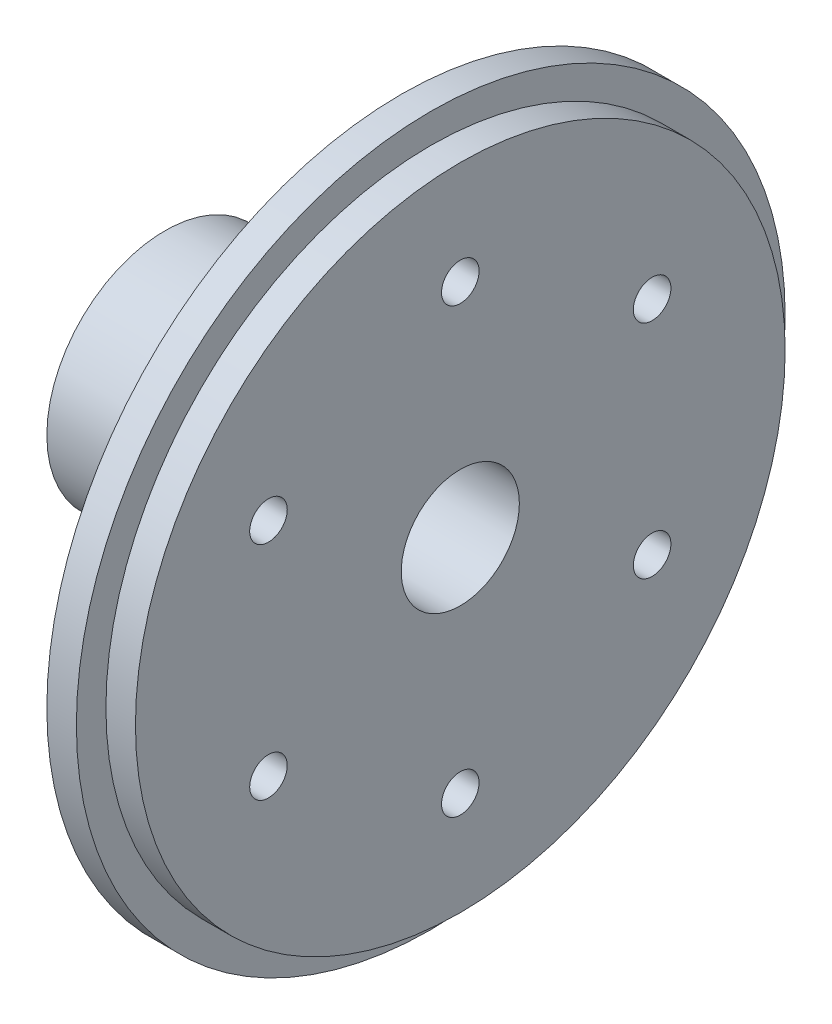
ISO-10303-21;
HEADER;
FILE_DESCRIPTION(('STEP AP214'),'2;1');
FILE_NAME('part.step','',(''),(''),'','','');
FILE_SCHEMA(('AUTOMOTIVE_DESIGN { 1 0 10303 214 1 1 1 1 }'));
ENDSEC;
DATA;
#1=APPLICATION_CONTEXT('core data for automotive mechanical design processes');
#2=APPLICATION_PROTOCOL_DEFINITION('international standard','automotive_design',2000,#1);
#3=PRODUCT_CONTEXT('',#1,'mechanical');
#4=PRODUCT('Part','Part','',(#3));
#5=PRODUCT_RELATED_PRODUCT_CATEGORY('part','',(#4));
#6=PRODUCT_DEFINITION_FORMATION('','',#4);
#7=PRODUCT_DEFINITION_CONTEXT('part definition',#1,'design');
#8=PRODUCT_DEFINITION('design','',#6,#7);
#9=PRODUCT_DEFINITION_SHAPE('','',#8);
#10=(LENGTH_UNIT() NAMED_UNIT(*) SI_UNIT(.MILLI.,.METRE.));
#11=(NAMED_UNIT(*) PLANE_ANGLE_UNIT() SI_UNIT($,.RADIAN.));
#12=(NAMED_UNIT(*) SI_UNIT($,.STERADIAN.) SOLID_ANGLE_UNIT());
#13=UNCERTAINTY_MEASURE_WITH_UNIT(LENGTH_MEASURE(1.E-05),#10,'distance_accuracy_value','');
#14=(GEOMETRIC_REPRESENTATION_CONTEXT(3) GLOBAL_UNCERTAINTY_ASSIGNED_CONTEXT((#13)) GLOBAL_UNIT_ASSIGNED_CONTEXT((#10,
#11,#12)) REPRESENTATION_CONTEXT('',''));
#15=CARTESIAN_POINT('',(0.,0.,0.));
#16=DIRECTION('',(0.,0.,1.));
#17=DIRECTION('',(1.,0.,0.));
#18=AXIS2_PLACEMENT_3D('',#15,#16,#17);
#19=CARTESIAN_POINT('',(6.35,0.,0.));
#20=DIRECTION('',(-1.,0.,0.));
#21=DIRECTION('',(0.,0.,1.));
#22=AXIS2_PLACEMENT_3D('',#19,#20,#21);
#23=CYLINDRICAL_SURFACE('',#22,38.1);
#24=CARTESIAN_POINT('',(0.,0.,0.));
#25=DIRECTION('',(1.,0.,0.));
#26=DIRECTION('',(0.,0.,-1.));
#27=AXIS2_PLACEMENT_3D('',#24,#25,#26);
#28=CIRCLE('',#27,38.1);
#29=CARTESIAN_POINT('',(0.,0.,-38.1));
#30=VERTEX_POINT('',#29);
#31=EDGE_CURVE('E44',#30,#30,#28,.T.);
#32=ORIENTED_EDGE('',*,*,#31,.T.);
#33=EDGE_LOOP('',(#32));
#34=FACE_BOUND('',#33,.T.);
#35=CARTESIAN_POINT('',(3.175,0.,0.));
#36=DIRECTION('',(1.,0.,0.));
#37=DIRECTION('',(0.,0.,-1.));
#38=AXIS2_PLACEMENT_3D('',#35,#36,#37);
#39=CIRCLE('',#38,38.1);
#40=CARTESIAN_POINT('',(3.175,0.,-38.1));
#41=VERTEX_POINT('',#40);
#42=EDGE_CURVE('E48',#41,#41,#39,.T.);
#43=ORIENTED_EDGE('',*,*,#42,.F.);
#44=EDGE_LOOP('',(#43));
#45=FACE_BOUND('',#44,.T.);
#46=ADVANCED_FACE('F38',(#34,#45),#23,.T.);
#47=CARTESIAN_POINT('',(0.,0.,0.));
#48=DIRECTION('',(1.,0.,0.));
#49=DIRECTION('',(0.,0.,-1.));
#50=AXIS2_PLACEMENT_3D('',#47,#48,#49);
#51=PLANE('',#50);
#52=CARTESIAN_POINT('',(0.,-11.9062500000001,20.6222299276169));
#53=DIRECTION('',(-1.,0.,0.));
#54=DIRECTION('',(0.,-0.866025403784436,-0.500000000000004));
#55=AXIS2_PLACEMENT_3D('',#52,#53,#54);
#56=CIRCLE('',#55,2.01929999999999);
#57=CARTESIAN_POINT('',(0.,-13.655015097862,19.6125799276169));
#58=VERTEX_POINT('',#57);
#59=EDGE_CURVE('E81',#58,#58,#56,.T.);
#60=ORIENTED_EDGE('',*,*,#59,.F.);
#61=EDGE_LOOP('',(#60));
#62=FACE_BOUND('',#61,.T.);
#63=CARTESIAN_POINT('',(0.,-23.8125,0.));
#64=DIRECTION('',(-1.,0.,0.));
#65=DIRECTION('',(0.,0.,-1.));
#66=AXIS2_PLACEMENT_3D('',#63,#64,#65);
#67=CIRCLE('',#66,2.01929999999999);
#68=CARTESIAN_POINT('',(0.,-23.8125,-2.01929999999999));
#69=VERTEX_POINT('',#68);
#70=EDGE_CURVE('E95',#69,#69,#67,.T.);
#71=ORIENTED_EDGE('',*,*,#70,.F.);
#72=EDGE_LOOP('',(#71));
#73=FACE_BOUND('',#72,.T.);
#74=CARTESIAN_POINT('',(0.,-11.9062499999998,-20.6222299276171));
#75=DIRECTION('',(-1.,0.,0.));
#76=DIRECTION('',(0.,0.866025403784443,-0.499999999999992));
#77=AXIS2_PLACEMENT_3D('',#74,#75,#76);
#78=CIRCLE('',#77,2.01929999999999);
#79=CARTESIAN_POINT('',(0.,-10.1574849021379,-21.631879927617));
#80=VERTEX_POINT('',#79);
#81=EDGE_CURVE('E89',#80,#80,#78,.T.);
#82=ORIENTED_EDGE('',*,*,#81,.F.);
#83=EDGE_LOOP('',(#82));
#84=FACE_BOUND('',#83,.T.);
#85=CARTESIAN_POINT('',(0.,11.9062500000002,-20.6222299276168));
#86=DIRECTION('',(-1.,0.,0.));
#87=DIRECTION('',(0.,0.866025403784433,0.50000000000001));
#88=AXIS2_PLACEMENT_3D('',#85,#86,#87);
#89=CIRCLE('',#88,2.01929999999999);
#90=CARTESIAN_POINT('',(0.,13.6550150978621,-19.6125799276168));
#91=VERTEX_POINT('',#90);
#92=EDGE_CURVE('E82',#91,#91,#89,.T.);
#93=ORIENTED_EDGE('',*,*,#92,.F.);
#94=EDGE_LOOP('',(#93));
#95=FACE_BOUND('',#94,.T.);
#96=CARTESIAN_POINT('',(0.,11.90625,20.622229927617));
#97=DIRECTION('',(-1.,0.,0.));
#98=DIRECTION('',(0.,-0.86602540378444,0.499999999999998));
#99=AXIS2_PLACEMENT_3D('',#96,#97,#98);
#100=CIRCLE('',#99,2.01929999999999);
#101=CARTESIAN_POINT('',(0.,10.157484902138,21.631879927617));
#102=VERTEX_POINT('',#101);
#103=EDGE_CURVE('E75',#102,#102,#100,.T.);
#104=ORIENTED_EDGE('',*,*,#103,.F.);
#105=EDGE_LOOP('',(#104));
#106=FACE_BOUND('',#105,.T.);
#107=CARTESIAN_POINT('',(0.,23.8125,0.));
#108=DIRECTION('',(-1.,0.,0.));
#109=DIRECTION('',(0.,0.,1.));
#110=AXIS2_PLACEMENT_3D('',#107,#108,#109);
#111=CIRCLE('',#110,2.01929999999999);
#112=CARTESIAN_POINT('',(0.,23.8125,2.01929999999999));
#113=VERTEX_POINT('',#112);
#114=EDGE_CURVE('E72',#113,#113,#111,.T.);
#115=ORIENTED_EDGE('',*,*,#114,.F.);
#116=EDGE_LOOP('',(#115));
#117=FACE_BOUND('',#116,.T.);
#118=CARTESIAN_POINT('',(0.,0.,0.));
#119=DIRECTION('',(1.,0.,0.));
#120=DIRECTION('',(0.,0.,-1.));
#121=AXIS2_PLACEMENT_3D('',#118,#119,#120);
#122=CIRCLE('',#121,12.7);
#123=CARTESIAN_POINT('',(0.,0.,-12.7));
#124=VERTEX_POINT('',#123);
#125=EDGE_CURVE('E11',#124,#124,#122,.F.);
#126=ORIENTED_EDGE('',*,*,#125,.F.);
#127=EDGE_LOOP('',(#126));
#128=FACE_BOUND('',#127,.T.);
#129=ORIENTED_EDGE('',*,*,#31,.F.);
#130=EDGE_LOOP('',(#129));
#131=FACE_BOUND('',#130,.T.);
#132=ADVANCED_FACE('F116',(#62,#73,#84,#95,#106,#117,#128,#131),#51,.F.);
#133=CARTESIAN_POINT('',(3.175,0.,0.));
#134=DIRECTION('',(1.,0.,0.));
#135=DIRECTION('',(0.,0.,-1.));
#136=AXIS2_PLACEMENT_3D('',#133,#134,#135);
#137=PLANE('',#136);
#138=CARTESIAN_POINT('',(3.175,0.,0.));
#139=DIRECTION('',(1.,0.,0.));
#140=DIRECTION('',(0.,0.,-1.));
#141=AXIS2_PLACEMENT_3D('',#138,#139,#140);
#142=CIRCLE('',#141,34.925);
#143=CARTESIAN_POINT('',(3.175,0.,-34.925));
#144=VERTEX_POINT('',#143);
#145=EDGE_CURVE('E52',#144,#144,#142,.T.);
#146=ORIENTED_EDGE('',*,*,#145,.F.);
#147=EDGE_LOOP('',(#146));
#148=FACE_BOUND('',#147,.T.);
#149=ORIENTED_EDGE('',*,*,#42,.T.);
#150=EDGE_LOOP('',(#149));
#151=FACE_BOUND('',#150,.T.);
#152=ADVANCED_FACE('F119',(#148,#151),#137,.T.);
#153=CARTESIAN_POINT('',(3.175,0.,0.));
#154=DIRECTION('',(1.,0.,0.));
#155=DIRECTION('',(0.,0.,-1.));
#156=AXIS2_PLACEMENT_3D('',#153,#154,#155);
#157=CYLINDRICAL_SURFACE('',#156,34.925);
#158=ORIENTED_EDGE('',*,*,#145,.T.);
#159=EDGE_LOOP('',(#158));
#160=FACE_BOUND('',#159,.T.);
#161=CARTESIAN_POINT('',(6.35,0.,0.));
#162=DIRECTION('',(1.,0.,0.));
#163=DIRECTION('',(0.,0.,-1.));
#164=AXIS2_PLACEMENT_3D('',#161,#162,#163);
#165=CIRCLE('',#164,34.925);
#166=CARTESIAN_POINT('',(6.35,0.,-34.925));
#167=VERTEX_POINT('',#166);
#168=EDGE_CURVE('E55',#167,#167,#165,.T.);
#169=ORIENTED_EDGE('',*,*,#168,.F.);
#170=EDGE_LOOP('',(#169));
#171=FACE_BOUND('',#170,.T.);
#172=ADVANCED_FACE('F156',(#160,#171),#157,.T.);
#173=CARTESIAN_POINT('',(6.35,0.,0.));
#174=DIRECTION('',(1.,0.,0.));
#175=DIRECTION('',(0.,0.,-1.));
#176=AXIS2_PLACEMENT_3D('',#173,#174,#175);
#177=PLANE('',#176);
#178=CARTESIAN_POINT('',(6.35,-11.9062500000001,20.6222299276169));
#179=DIRECTION('',(-1.,0.,0.));
#180=DIRECTION('',(0.,-0.866025403784436,-0.500000000000004));
#181=AXIS2_PLACEMENT_3D('',#178,#179,#180);
#182=CIRCLE('',#181,2.01929999999999);
#183=CARTESIAN_POINT('',(6.35,-13.655015097862,19.6125799276169));
#184=VERTEX_POINT('',#183);
#185=EDGE_CURVE('E98',#184,#184,#182,.T.);
#186=ORIENTED_EDGE('',*,*,#185,.T.);
#187=EDGE_LOOP('',(#186));
#188=FACE_BOUND('',#187,.T.);
#189=CARTESIAN_POINT('',(6.35,-23.8125,0.));
#190=DIRECTION('',(-1.,0.,0.));
#191=DIRECTION('',(0.,0.,-1.));
#192=AXIS2_PLACEMENT_3D('',#189,#190,#191);
#193=CIRCLE('',#192,2.01929999999999);
#194=CARTESIAN_POINT('',(6.35,-23.8125,-2.01929999999999));
#195=VERTEX_POINT('',#194);
#196=EDGE_CURVE('E92',#195,#195,#193,.T.);
#197=ORIENTED_EDGE('',*,*,#196,.T.);
#198=EDGE_LOOP('',(#197));
#199=FACE_BOUND('',#198,.T.);
#200=CARTESIAN_POINT('',(6.35,-11.9062499999998,-20.6222299276171));
#201=DIRECTION('',(-1.,0.,0.));
#202=DIRECTION('',(0.,0.866025403784443,-0.499999999999992));
#203=AXIS2_PLACEMENT_3D('',#200,#201,#202);
#204=CIRCLE('',#203,2.01929999999999);
#205=CARTESIAN_POINT('',(6.35,-10.1574849021379,-21.631879927617));
#206=VERTEX_POINT('',#205);
#207=EDGE_CURVE('E85',#206,#206,#204,.T.);
#208=ORIENTED_EDGE('',*,*,#207,.T.);
#209=EDGE_LOOP('',(#208));
#210=FACE_BOUND('',#209,.T.);
#211=CARTESIAN_POINT('',(6.35,11.9062500000002,-20.6222299276168));
#212=DIRECTION('',(-1.,0.,0.));
#213=DIRECTION('',(0.,0.866025403784433,0.50000000000001));
#214=AXIS2_PLACEMENT_3D('',#211,#212,#213);
#215=CIRCLE('',#214,2.01929999999999);
#216=CARTESIAN_POINT('',(6.35,13.6550150978621,-19.6125799276168));
#217=VERTEX_POINT('',#216);
#218=EDGE_CURVE('E86',#217,#217,#215,.T.);
#219=ORIENTED_EDGE('',*,*,#218,.T.);
#220=EDGE_LOOP('',(#219));
#221=FACE_BOUND('',#220,.T.);
#222=CARTESIAN_POINT('',(6.35,11.90625,20.622229927617));
#223=DIRECTION('',(-1.,0.,0.));
#224=DIRECTION('',(0.,-0.86602540378444,0.499999999999998));
#225=AXIS2_PLACEMENT_3D('',#222,#223,#224);
#226=CIRCLE('',#225,2.01929999999999);
#227=CARTESIAN_POINT('',(6.35,10.157484902138,21.631879927617));
#228=VERTEX_POINT('',#227);
#229=EDGE_CURVE('E78',#228,#228,#226,.T.);
#230=ORIENTED_EDGE('',*,*,#229,.T.);
#231=EDGE_LOOP('',(#230));
#232=FACE_BOUND('',#231,.T.);
#233=CARTESIAN_POINT('',(6.35,23.8125,0.));
#234=DIRECTION('',(-1.,0.,0.));
#235=DIRECTION('',(0.,0.,1.));
#236=AXIS2_PLACEMENT_3D('',#233,#234,#235);
#237=CIRCLE('',#236,2.01929999999999);
#238=CARTESIAN_POINT('',(6.35,23.8125,2.01929999999999));
#239=VERTEX_POINT('',#238);
#240=EDGE_CURVE('E69',#239,#239,#237,.T.);
#241=ORIENTED_EDGE('',*,*,#240,.T.);
#242=EDGE_LOOP('',(#241));
#243=FACE_BOUND('',#242,.T.);
#244=CARTESIAN_POINT('',(6.35,0.,0.));
#245=DIRECTION('',(1.,0.,0.));
#246=DIRECTION('',(0.,0.,-1.));
#247=AXIS2_PLACEMENT_3D('',#244,#245,#246);
#248=CIRCLE('',#247,6.35);
#249=CARTESIAN_POINT('',(6.35,0.,-6.35));
#250=VERTEX_POINT('',#249);
#251=EDGE_CURVE('E66',#250,#250,#248,.T.);
#252=ORIENTED_EDGE('',*,*,#251,.F.);
#253=EDGE_LOOP('',(#252));
#254=FACE_BOUND('',#253,.T.);
#255=ORIENTED_EDGE('',*,*,#168,.T.);
#256=EDGE_LOOP('',(#255));
#257=FACE_BOUND('',#256,.T.);
#258=ADVANCED_FACE('F106',(#188,#199,#210,#221,#232,#243,#254,#257),#177,.T.);
#259=CARTESIAN_POINT('',(-25.4,0.,0.));
#260=DIRECTION('',(1.,0.,0.));
#261=DIRECTION('',(0.,0.,-1.));
#262=AXIS2_PLACEMENT_3D('',#259,#260,#261);
#263=CYLINDRICAL_SURFACE('',#262,12.7);
#264=CARTESIAN_POINT('',(-25.4,0.,0.));
#265=DIRECTION('',(-1.,0.,0.));
#266=DIRECTION('',(0.,0.,1.));
#267=AXIS2_PLACEMENT_3D('',#264,#265,#266);
#268=CIRCLE('',#267,12.7);
#269=CARTESIAN_POINT('',(-25.4,0.,12.7));
#270=VERTEX_POINT('',#269);
#271=EDGE_CURVE('E58',#270,#270,#268,.T.);
#272=ORIENTED_EDGE('',*,*,#271,.F.);
#273=EDGE_LOOP('',(#272));
#274=FACE_BOUND('',#273,.T.);
#275=ORIENTED_EDGE('',*,*,#125,.T.);
#276=EDGE_LOOP('',(#275));
#277=FACE_BOUND('',#276,.T.);
#278=ADVANCED_FACE('F168',(#274,#277),#263,.T.);
#279=CARTESIAN_POINT('',(-25.4,0.,0.));
#280=DIRECTION('',(-1.,0.,0.));
#281=DIRECTION('',(0.,0.,1.));
#282=AXIS2_PLACEMENT_3D('',#279,#280,#281);
#283=PLANE('',#282);
#284=CARTESIAN_POINT('',(-25.4,0.,0.));
#285=DIRECTION('',(1.,0.,0.));
#286=DIRECTION('',(0.,0.,-1.));
#287=AXIS2_PLACEMENT_3D('',#284,#285,#286);
#288=CIRCLE('',#287,6.34999999999999);
#289=CARTESIAN_POINT('',(-25.4,0.,-6.34999999999999));
#290=VERTEX_POINT('',#289);
#291=EDGE_CURVE('E63',#290,#290,#288,.T.);
#292=ORIENTED_EDGE('',*,*,#291,.T.);
#293=EDGE_LOOP('',(#292));
#294=FACE_BOUND('',#293,.T.);
#295=ORIENTED_EDGE('',*,*,#271,.T.);
#296=EDGE_LOOP('',(#295));
#297=FACE_BOUND('',#296,.T.);
#298=ADVANCED_FACE('F145',(#294,#297),#283,.T.);
#299=CARTESIAN_POINT('',(6.35,0.,0.));
#300=DIRECTION('',(1.,0.,0.));
#301=DIRECTION('',(0.,0.,-1.));
#302=AXIS2_PLACEMENT_3D('',#299,#300,#301);
#303=CYLINDRICAL_SURFACE('',#302,6.35);
#304=ORIENTED_EDGE('',*,*,#291,.F.);
#305=EDGE_LOOP('',(#304));
#306=FACE_BOUND('',#305,.T.);
#307=ORIENTED_EDGE('',*,*,#251,.T.);
#308=EDGE_LOOP('',(#307));
#309=FACE_BOUND('',#308,.T.);
#310=ADVANCED_FACE('F135',(#306,#309),#303,.F.);
#311=CARTESIAN_POINT('',(0.,23.8125,0.));
#312=DIRECTION('',(-1.,0.,0.));
#313=DIRECTION('',(0.,0.,1.));
#314=AXIS2_PLACEMENT_3D('',#311,#312,#313);
#315=CYLINDRICAL_SURFACE('',#314,2.01929999999999);
#316=ORIENTED_EDGE('',*,*,#240,.F.);
#317=EDGE_LOOP('',(#316));
#318=FACE_BOUND('',#317,.T.);
#319=ORIENTED_EDGE('',*,*,#114,.T.);
#320=EDGE_LOOP('',(#319));
#321=FACE_BOUND('',#320,.T.);
#322=ADVANCED_FACE('F132',(#318,#321),#315,.F.);
#323=CARTESIAN_POINT('',(0.,11.90625,20.622229927617));
#324=DIRECTION('',(-1.,0.,0.));
#325=DIRECTION('',(0.,-0.86602540378444,0.499999999999998));
#326=AXIS2_PLACEMENT_3D('',#323,#324,#325);
#327=CYLINDRICAL_SURFACE('',#326,2.01929999999999);
#328=ORIENTED_EDGE('',*,*,#229,.F.);
#329=EDGE_LOOP('',(#328));
#330=FACE_BOUND('',#329,.T.);
#331=ORIENTED_EDGE('',*,*,#103,.T.);
#332=EDGE_LOOP('',(#331));
#333=FACE_BOUND('',#332,.T.);
#334=ADVANCED_FACE('F134',(#330,#333),#327,.F.);
#335=CARTESIAN_POINT('',(0.,11.9062500000002,-20.6222299276168));
#336=DIRECTION('',(-1.,0.,0.));
#337=DIRECTION('',(0.,0.866025403784433,0.50000000000001));
#338=AXIS2_PLACEMENT_3D('',#335,#336,#337);
#339=CYLINDRICAL_SURFACE('',#338,2.01929999999999);
#340=ORIENTED_EDGE('',*,*,#218,.F.);
#341=EDGE_LOOP('',(#340));
#342=FACE_BOUND('',#341,.T.);
#343=ORIENTED_EDGE('',*,*,#92,.T.);
#344=EDGE_LOOP('',(#343));
#345=FACE_BOUND('',#344,.T.);
#346=ADVANCED_FACE('F142',(#342,#345),#339,.F.);
#347=CARTESIAN_POINT('',(0.,-11.9062499999998,-20.6222299276171));
#348=DIRECTION('',(-1.,0.,0.));
#349=DIRECTION('',(0.,0.866025403784443,-0.499999999999992));
#350=AXIS2_PLACEMENT_3D('',#347,#348,#349);
#351=CYLINDRICAL_SURFACE('',#350,2.01929999999999);
#352=ORIENTED_EDGE('',*,*,#207,.F.);
#353=EDGE_LOOP('',(#352));
#354=FACE_BOUND('',#353,.T.);
#355=ORIENTED_EDGE('',*,*,#81,.T.);
#356=EDGE_LOOP('',(#355));
#357=FACE_BOUND('',#356,.T.);
#358=ADVANCED_FACE('F230',(#354,#357),#351,.F.);
#359=CARTESIAN_POINT('',(0.,-23.8125,0.));
#360=DIRECTION('',(-1.,0.,0.));
#361=DIRECTION('',(0.,0.,-1.));
#362=AXIS2_PLACEMENT_3D('',#359,#360,#361);
#363=CYLINDRICAL_SURFACE('',#362,2.01929999999999);
#364=ORIENTED_EDGE('',*,*,#196,.F.);
#365=EDGE_LOOP('',(#364));
#366=FACE_BOUND('',#365,.T.);
#367=ORIENTED_EDGE('',*,*,#70,.T.);
#368=EDGE_LOOP('',(#367));
#369=FACE_BOUND('',#368,.T.);
#370=ADVANCED_FACE('F112',(#366,#369),#363,.F.);
#371=CARTESIAN_POINT('',(0.,-11.9062500000001,20.6222299276169));
#372=DIRECTION('',(-1.,0.,0.));
#373=DIRECTION('',(0.,-0.866025403784436,-0.500000000000004));
#374=AXIS2_PLACEMENT_3D('',#371,#372,#373);
#375=CYLINDRICAL_SURFACE('',#374,2.01929999999999);
#376=ORIENTED_EDGE('',*,*,#185,.F.);
#377=EDGE_LOOP('',(#376));
#378=FACE_BOUND('',#377,.T.);
#379=ORIENTED_EDGE('',*,*,#59,.T.);
#380=EDGE_LOOP('',(#379));
#381=FACE_BOUND('',#380,.T.);
#382=ADVANCED_FACE('F109',(#378,#381),#375,.F.);
#383=CLOSED_SHELL('',(#46,#132,#152,#172,#258,#278,#298,#310,#322,#334,#346,#358,#370,#382));
#384=MANIFOLD_SOLID_BREP('B2',#383);
#385=ADVANCED_BREP_SHAPE_REPRESENTATION('',(#18,#384),#14);
#386=SHAPE_DEFINITION_REPRESENTATION(#9,#385);
ENDSEC;
END-ISO-10303-21;
